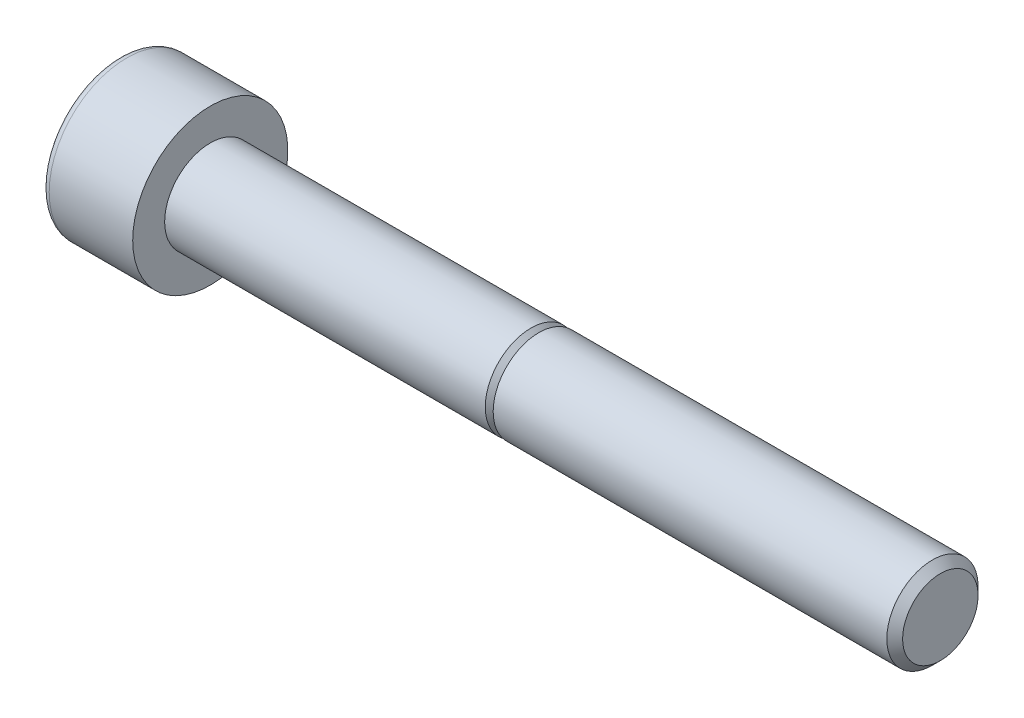
ISO-10303-21;
HEADER;
FILE_DESCRIPTION(('STEP AP214'),'2;1');
FILE_NAME('part.step','',(''),(''),'','','');
FILE_SCHEMA(('AUTOMOTIVE_DESIGN { 1 0 10303 214 1 1 1 1 }'));
ENDSEC;
DATA;
#1=APPLICATION_CONTEXT('core data for automotive mechanical design processes');
#2=APPLICATION_PROTOCOL_DEFINITION('international standard','automotive_design',2000,#1);
#3=PRODUCT_CONTEXT('',#1,'mechanical');
#4=PRODUCT('Part','Part','',(#3));
#5=PRODUCT_RELATED_PRODUCT_CATEGORY('part','',(#4));
#6=PRODUCT_DEFINITION_FORMATION('','',#4);
#7=PRODUCT_DEFINITION_CONTEXT('part definition',#1,'design');
#8=PRODUCT_DEFINITION('design','',#6,#7);
#9=PRODUCT_DEFINITION_SHAPE('','',#8);
#10=(LENGTH_UNIT() NAMED_UNIT(*) SI_UNIT(.MILLI.,.METRE.));
#11=(NAMED_UNIT(*) PLANE_ANGLE_UNIT() SI_UNIT($,.RADIAN.));
#12=(NAMED_UNIT(*) SI_UNIT($,.STERADIAN.) SOLID_ANGLE_UNIT());
#13=UNCERTAINTY_MEASURE_WITH_UNIT(LENGTH_MEASURE(1.E-05),#10,'distance_accuracy_value','');
#14=(GEOMETRIC_REPRESENTATION_CONTEXT(3) GLOBAL_UNCERTAINTY_ASSIGNED_CONTEXT((#13)) GLOBAL_UNIT_ASSIGNED_CONTEXT((#10,
#11,#12)) REPRESENTATION_CONTEXT('',''));
#15=CARTESIAN_POINT('',(0.,0.,0.));
#16=DIRECTION('',(0.,0.,1.));
#17=DIRECTION('',(1.,0.,0.));
#18=AXIS2_PLACEMENT_3D('',#15,#16,#17);
#19=CARTESIAN_POINT('',(0.,0.,0.));
#20=DIRECTION('',(-1.,0.,0.));
#21=DIRECTION('',(0.,0.,1.));
#22=AXIS2_PLACEMENT_3D('',#19,#20,#21);
#23=PLANE('',#22);
#24=CARTESIAN_POINT('',(0.,0.,0.));
#25=DIRECTION('',(-1.,0.,0.));
#26=DIRECTION('',(0.,0.,1.));
#27=AXIS2_PLACEMENT_3D('',#24,#25,#26);
#28=CIRCLE('',#27,4.25);
#29=CARTESIAN_POINT('',(0.,0.,4.25));
#30=VERTEX_POINT('',#29);
#31=EDGE_CURVE('E109',#30,#30,#28,.T.);
#32=ORIENTED_EDGE('',*,*,#31,.F.);
#33=EDGE_LOOP('',(#32));
#34=FACE_BOUND('',#33,.T.);
#35=CARTESIAN_POINT('',(0.,0.,0.));
#36=DIRECTION('',(-1.,0.,0.));
#37=DIRECTION('',(0.,0.,1.));
#38=AXIS2_PLACEMENT_3D('',#35,#36,#37);
#39=CIRCLE('',#38,2.5);
#40=CARTESIAN_POINT('',(0.,0.,2.5));
#41=VERTEX_POINT('',#40);
#42=EDGE_CURVE('E11',#41,#41,#39,.F.);
#43=ORIENTED_EDGE('',*,*,#42,.F.);
#44=EDGE_LOOP('',(#43));
#45=FACE_BOUND('',#44,.T.);
#46=ADVANCED_FACE('F16',(#34,#45),#23,.F.);
#47=CARTESIAN_POINT('',(-5.,3.825,0.));
#48=DIRECTION('',(1.,0.,0.));
#49=DIRECTION('',(0.,0.,-1.));
#50=AXIS2_PLACEMENT_3D('',#47,#48,#49);
#51=PLANE('',#50);
#52=CARTESIAN_POINT('',(-5.,0.,0.));
#53=DIRECTION('',(-1.,0.,0.));
#54=DIRECTION('',(0.,0.,1.));
#55=AXIS2_PLACEMENT_3D('',#52,#53,#54);
#56=CIRCLE('',#55,3.825);
#57=CARTESIAN_POINT('',(-5.,0.,3.825));
#58=VERTEX_POINT('',#57);
#59=EDGE_CURVE('E91',#58,#58,#56,.T.);
#60=ORIENTED_EDGE('',*,*,#59,.T.);
#61=EDGE_LOOP('',(#60));
#62=FACE_BOUND('',#61,.T.);
#63=DIRECTION('',(0.,0.5,0.866025403784438));
#64=VECTOR('',#63,1.);
#65=CARTESIAN_POINT('',(-5.,-0.775800807568874,2.65627358473774));
#66=LINE('',#65,#64);
#67=CARTESIAN_POINT('',(-5.,-2.30940107675851,0.));
#68=VERTEX_POINT('',#67);
#69=CARTESIAN_POINT('',(-5.,-1.15470053837925,2.));
#70=VERTEX_POINT('',#69);
#71=EDGE_CURVE('E25',#68,#70,#66,.T.);
#72=ORIENTED_EDGE('',*,*,#71,.F.);
#73=DIRECTION('',(0.,-0.5,0.866025403784439));
#74=VECTOR('',#73,1.);
#75=CARTESIAN_POINT('',(-5.,-0.775800807568879,-2.65627358473774));
#76=LINE('',#75,#74);
#77=CARTESIAN_POINT('',(-5.,-1.15470053837925,-2.));
#78=VERTEX_POINT('',#77);
#79=EDGE_CURVE('E40',#78,#68,#76,.T.);
#80=ORIENTED_EDGE('',*,*,#79,.F.);
#81=DIRECTION('',(0.,-1.,0.));
#82=VECTOR('',#81,1.);
#83=CARTESIAN_POINT('',(-5.,3.825,-2.));
#84=LINE('',#83,#82);
#85=CARTESIAN_POINT('',(-5.,1.15470053837925,-2.));
#86=VERTEX_POINT('',#85);
#87=EDGE_CURVE('E122',#86,#78,#84,.T.);
#88=ORIENTED_EDGE('',*,*,#87,.F.);
#89=DIRECTION('',(0.,-0.5,-0.866025403784439));
#90=VECTOR('',#89,1.);
#91=CARTESIAN_POINT('',(-5.,2.68830080756888,0.656273584737739));
#92=LINE('',#91,#90);
#93=CARTESIAN_POINT('',(-5.,2.30940107675851,0.));
#94=VERTEX_POINT('',#93);
#95=EDGE_CURVE('E119',#94,#86,#92,.T.);
#96=ORIENTED_EDGE('',*,*,#95,.F.);
#97=DIRECTION('',(0.,0.5,-0.866025403784439));
#98=VECTOR('',#97,1.);
#99=CARTESIAN_POINT('',(-5.,2.68830080756888,-0.656273584737739));
#100=LINE('',#99,#98);
#101=CARTESIAN_POINT('',(-5.,1.15470053837925,2.));
#102=VERTEX_POINT('',#101);
#103=EDGE_CURVE('E116',#102,#94,#100,.T.);
#104=ORIENTED_EDGE('',*,*,#103,.F.);
#105=DIRECTION('',(0.,1.,0.));
#106=VECTOR('',#105,1.);
#107=CARTESIAN_POINT('',(-5.,3.825,2.));
#108=LINE('',#107,#106);
#109=EDGE_CURVE('E113',#70,#102,#108,.T.);
#110=ORIENTED_EDGE('',*,*,#109,.F.);
#111=EDGE_LOOP('',(#72,#80,#88,#96,#104,#110));
#112=FACE_BOUND('',#111,.T.);
#113=ADVANCED_FACE('F18',(#62,#112),#51,.F.);
#114=CARTESIAN_POINT('',(-5.,0.,0.));
#115=DIRECTION('',(-1.,0.,0.));
#116=DIRECTION('',(0.,0.,1.));
#117=AXIS2_PLACEMENT_3D('',#114,#115,#116);
#118=CYLINDRICAL_SURFACE('',#117,4.25);
#119=CARTESIAN_POINT('',(-4.575,0.,0.));
#120=DIRECTION('',(-1.,0.,0.));
#121=DIRECTION('',(0.,0.,1.));
#122=AXIS2_PLACEMENT_3D('',#119,#120,#121);
#123=CIRCLE('',#122,4.25);
#124=CARTESIAN_POINT('',(-4.575,0.,4.25));
#125=VERTEX_POINT('',#124);
#126=EDGE_CURVE('E99',#125,#125,#123,.T.);
#127=ORIENTED_EDGE('',*,*,#126,.F.);
#128=EDGE_LOOP('',(#127));
#129=FACE_BOUND('',#128,.T.);
#130=ORIENTED_EDGE('',*,*,#31,.T.);
#131=EDGE_LOOP('',(#130));
#132=FACE_BOUND('',#131,.T.);
#133=ADVANCED_FACE('F238',(#129,#132),#118,.T.);
#134=CARTESIAN_POINT('',(-4.575,0.,0.));
#135=DIRECTION('',(-1.,0.,0.));
#136=DIRECTION('',(0.,0.,1.));
#137=AXIS2_PLACEMENT_3D('',#134,#135,#136);
#138=TOROIDAL_SURFACE('',#137,3.825,0.425);
#139=ORIENTED_EDGE('',*,*,#59,.F.);
#140=EDGE_LOOP('',(#139));
#141=FACE_BOUND('',#140,.T.);
#142=ORIENTED_EDGE('',*,*,#126,.T.);
#143=EDGE_LOOP('',(#142));
#144=FACE_BOUND('',#143,.T.);
#145=ADVANCED_FACE('F245',(#141,#144),#138,.T.);
#146=CARTESIAN_POINT('',(-2.5,-1.15470053837925,2.));
#147=DIRECTION('',(0.,0.866025403784438,-0.5));
#148=DIRECTION('',(0.,0.5,0.866025403784438));
#149=AXIS2_PLACEMENT_3D('',#146,#147,#148);
#150=PLANE('',#149);
#151=ORIENTED_EDGE('',*,*,#71,.T.);
#152=DIRECTION('',(-1.,0.,0.));
#153=VECTOR('',#152,1.);
#154=CARTESIAN_POINT('',(-2.5,-1.15470053837925,2.));
#155=LINE('',#154,#153);
#156=CARTESIAN_POINT('',(-2.5,-1.15470053837925,2.));
#157=VERTEX_POINT('',#156);
#158=EDGE_CURVE('E32',#157,#70,#155,.T.);
#159=ORIENTED_EDGE('',*,*,#158,.F.);
#160=DIRECTION('',(0.,-0.5,-0.866025403784439));
#161=VECTOR('',#160,1.);
#162=CARTESIAN_POINT('',(-2.5,-1.15470053837925,2.));
#163=LINE('',#162,#161);
#164=CARTESIAN_POINT('',(-2.5,-2.30940107675851,0.));
#165=VERTEX_POINT('',#164);
#166=EDGE_CURVE('E76',#157,#165,#163,.T.);
#167=ORIENTED_EDGE('',*,*,#166,.T.);
#168=DIRECTION('',(-1.,0.,0.));
#169=VECTOR('',#168,1.);
#170=CARTESIAN_POINT('',(-2.5,-2.30940107675851,0.));
#171=LINE('',#170,#169);
#172=EDGE_CURVE('E84',#165,#68,#171,.T.);
#173=ORIENTED_EDGE('',*,*,#172,.T.);
#174=EDGE_LOOP('',(#151,#159,#167,#173));
#175=FACE_BOUND('',#174,.T.);
#176=ADVANCED_FACE('F83',(#175),#150,.T.);
#177=CARTESIAN_POINT('',(-2.5,-2.30940107675851,0.));
#178=DIRECTION('',(0.,0.866025403784439,0.5));
#179=DIRECTION('',(0.,-0.5,0.866025403784439));
#180=AXIS2_PLACEMENT_3D('',#177,#178,#179);
#181=PLANE('',#180);
#182=ORIENTED_EDGE('',*,*,#79,.T.);
#183=ORIENTED_EDGE('',*,*,#172,.F.);
#184=DIRECTION('',(0.,0.5,-0.866025403784439));
#185=VECTOR('',#184,1.);
#186=CARTESIAN_POINT('',(-2.5,-2.30940107675851,0.));
#187=LINE('',#186,#185);
#188=CARTESIAN_POINT('',(-2.5,-1.15470053837925,-2.));
#189=VERTEX_POINT('',#188);
#190=EDGE_CURVE('E72',#165,#189,#187,.T.);
#191=ORIENTED_EDGE('',*,*,#190,.T.);
#192=DIRECTION('',(-1.,0.,0.));
#193=VECTOR('',#192,1.);
#194=CARTESIAN_POINT('',(-2.5,-1.15470053837925,-2.));
#195=LINE('',#194,#193);
#196=EDGE_CURVE('E92',#189,#78,#195,.T.);
#197=ORIENTED_EDGE('',*,*,#196,.T.);
#198=EDGE_LOOP('',(#182,#183,#191,#197));
#199=FACE_BOUND('',#198,.T.);
#200=ADVANCED_FACE('F89',(#199),#181,.T.);
#201=CARTESIAN_POINT('',(-2.5,-1.15470053837925,-2.));
#202=DIRECTION('',(0.,0.,1.));
#203=DIRECTION('',(0.,-1.,0.));
#204=AXIS2_PLACEMENT_3D('',#201,#202,#203);
#205=PLANE('',#204);
#206=ORIENTED_EDGE('',*,*,#87,.T.);
#207=ORIENTED_EDGE('',*,*,#196,.F.);
#208=DIRECTION('',(0.,1.,0.));
#209=VECTOR('',#208,1.);
#210=CARTESIAN_POINT('',(-2.5,-1.15470053837925,-2.));
#211=LINE('',#210,#209);
#212=CARTESIAN_POINT('',(-2.5,1.15470053837925,-2.));
#213=VERTEX_POINT('',#212);
#214=EDGE_CURVE('E78',#189,#213,#211,.T.);
#215=ORIENTED_EDGE('',*,*,#214,.T.);
#216=DIRECTION('',(-1.,0.,0.));
#217=VECTOR('',#216,1.);
#218=CARTESIAN_POINT('',(-2.5,1.15470053837925,-2.));
#219=LINE('',#218,#217);
#220=EDGE_CURVE('E102',#213,#86,#219,.T.);
#221=ORIENTED_EDGE('',*,*,#220,.T.);
#222=EDGE_LOOP('',(#206,#207,#215,#221));
#223=FACE_BOUND('',#222,.T.);
#224=ADVANCED_FACE('F161',(#223),#205,.T.);
#225=CARTESIAN_POINT('',(-2.5,1.15470053837925,-2.));
#226=DIRECTION('',(0.,-0.866025403784438,0.5));
#227=DIRECTION('',(0.,-0.5,-0.866025403784439));
#228=AXIS2_PLACEMENT_3D('',#225,#226,#227);
#229=PLANE('',#228);
#230=ORIENTED_EDGE('',*,*,#95,.T.);
#231=ORIENTED_EDGE('',*,*,#220,.F.);
#232=DIRECTION('',(0.,0.5,0.866025403784439));
#233=VECTOR('',#232,1.);
#234=CARTESIAN_POINT('',(-2.5,1.15470053837925,-2.));
#235=LINE('',#234,#233);
#236=CARTESIAN_POINT('',(-2.5,2.30940107675851,0.));
#237=VERTEX_POINT('',#236);
#238=EDGE_CURVE('E164',#213,#237,#235,.T.);
#239=ORIENTED_EDGE('',*,*,#238,.T.);
#240=DIRECTION('',(-1.,0.,0.));
#241=VECTOR('',#240,1.);
#242=CARTESIAN_POINT('',(-2.5,2.30940107675851,0.));
#243=LINE('',#242,#241);
#244=EDGE_CURVE('E143',#237,#94,#243,.T.);
#245=ORIENTED_EDGE('',*,*,#244,.T.);
#246=EDGE_LOOP('',(#230,#231,#239,#245));
#247=FACE_BOUND('',#246,.T.);
#248=ADVANCED_FACE('F163',(#247),#229,.T.);
#249=CARTESIAN_POINT('',(-2.5,2.30940107675851,0.));
#250=DIRECTION('',(0.,-0.866025403784439,-0.5));
#251=DIRECTION('',(0.,0.5,-0.866025403784439));
#252=AXIS2_PLACEMENT_3D('',#249,#250,#251);
#253=PLANE('',#252);
#254=ORIENTED_EDGE('',*,*,#103,.T.);
#255=ORIENTED_EDGE('',*,*,#244,.F.);
#256=DIRECTION('',(0.,-0.5,0.866025403784439));
#257=VECTOR('',#256,1.);
#258=CARTESIAN_POINT('',(-2.5,2.30940107675851,0.));
#259=LINE('',#258,#257);
#260=CARTESIAN_POINT('',(-2.5,1.15470053837925,2.));
#261=VERTEX_POINT('',#260);
#262=EDGE_CURVE('E141',#237,#261,#259,.T.);
#263=ORIENTED_EDGE('',*,*,#262,.T.);
#264=DIRECTION('',(-1.,0.,0.));
#265=VECTOR('',#264,1.);
#266=CARTESIAN_POINT('',(-2.5,1.15470053837925,2.));
#267=LINE('',#266,#265);
#268=EDGE_CURVE('E135',#261,#102,#267,.T.);
#269=ORIENTED_EDGE('',*,*,#268,.T.);
#270=EDGE_LOOP('',(#254,#255,#263,#269));
#271=FACE_BOUND('',#270,.T.);
#272=ADVANCED_FACE('F137',(#271),#253,.T.);
#273=CARTESIAN_POINT('',(-2.5,1.15470053837925,2.));
#274=DIRECTION('',(0.,0.,-1.));
#275=DIRECTION('',(0.,1.,0.));
#276=AXIS2_PLACEMENT_3D('',#273,#274,#275);
#277=PLANE('',#276);
#278=ORIENTED_EDGE('',*,*,#109,.T.);
#279=ORIENTED_EDGE('',*,*,#268,.F.);
#280=DIRECTION('',(0.,-1.,0.));
#281=VECTOR('',#280,1.);
#282=CARTESIAN_POINT('',(-2.5,1.15470053837925,2.));
#283=LINE('',#282,#281);
#284=EDGE_CURVE('E151',#261,#157,#283,.T.);
#285=ORIENTED_EDGE('',*,*,#284,.T.);
#286=ORIENTED_EDGE('',*,*,#158,.T.);
#287=EDGE_LOOP('',(#278,#279,#285,#286));
#288=FACE_BOUND('',#287,.T.);
#289=ADVANCED_FACE('F134',(#288),#277,.T.);
#290=CARTESIAN_POINT('',(-2.5,-2.30940107675851,0.));
#291=DIRECTION('',(1.,0.,0.));
#292=DIRECTION('',(0.,0.,1.));
#293=AXIS2_PLACEMENT_3D('',#290,#291,#292);
#294=PLANE('',#293);
#295=ORIENTED_EDGE('',*,*,#166,.F.);
#296=ORIENTED_EDGE('',*,*,#284,.F.);
#297=ORIENTED_EDGE('',*,*,#262,.F.);
#298=ORIENTED_EDGE('',*,*,#238,.F.);
#299=ORIENTED_EDGE('',*,*,#214,.F.);
#300=ORIENTED_EDGE('',*,*,#190,.F.);
#301=EDGE_LOOP('',(#295,#296,#297,#298,#299,#300));
#302=FACE_BOUND('',#301,.T.);
#303=ADVANCED_FACE('F74',(#302),#294,.F.);
#304=CARTESIAN_POINT('',(0.,0.,0.));
#305=DIRECTION('',(-1.,0.,0.));
#306=DIRECTION('',(0.,0.,1.));
#307=AXIS2_PLACEMENT_3D('',#304,#305,#306);
#308=CYLINDRICAL_SURFACE('',#307,2.5);
#309=CARTESIAN_POINT('',(17.567,0.,0.));
#310=DIRECTION('',(-1.,0.,0.));
#311=DIRECTION('',(0.,0.,1.));
#312=AXIS2_PLACEMENT_3D('',#309,#310,#311);
#313=CIRCLE('',#312,2.5);
#314=CARTESIAN_POINT('',(17.567,0.,2.5));
#315=VERTEX_POINT('',#314);
#316=EDGE_CURVE('E189',#315,#315,#313,.T.);
#317=ORIENTED_EDGE('',*,*,#316,.T.);
#318=EDGE_LOOP('',(#317));
#319=FACE_BOUND('',#318,.T.);
#320=ORIENTED_EDGE('',*,*,#42,.T.);
#321=EDGE_LOOP('',(#320));
#322=FACE_BOUND('',#321,.T.);
#323=ADVANCED_FACE('F197',(#319,#322),#308,.T.);
#324=CARTESIAN_POINT('',(40.,0.,0.));
#325=DIRECTION('',(-1.,0.,0.));
#326=DIRECTION('',(0.,0.,1.));
#327=AXIS2_PLACEMENT_3D('',#324,#325,#326);
#328=PLANE('',#327);
#329=CARTESIAN_POINT('',(40.,0.,0.));
#330=DIRECTION('',(-1.,0.,0.));
#331=DIRECTION('',(0.,0.,1.));
#332=AXIS2_PLACEMENT_3D('',#329,#330,#331);
#333=CIRCLE('',#332,2.067);
#334=CARTESIAN_POINT('',(40.,0.,2.067));
#335=VERTEX_POINT('',#334);
#336=EDGE_CURVE('E87',#335,#335,#333,.T.);
#337=ORIENTED_EDGE('',*,*,#336,.F.);
#338=EDGE_LOOP('',(#337));
#339=FACE_BOUND('',#338,.T.);
#340=ADVANCED_FACE('F221',(#339),#328,.F.);
#341=CARTESIAN_POINT('',(40.,0.,0.));
#342=DIRECTION('',(-1.,0.,0.));
#343=DIRECTION('',(0.,0.,1.));
#344=AXIS2_PLACEMENT_3D('',#341,#342,#343);
#345=CONICAL_SURFACE('',#344,2.067,0.785398163397449);
#346=CARTESIAN_POINT('',(39.567,0.,0.));
#347=DIRECTION('',(-1.,0.,0.));
#348=DIRECTION('',(0.,0.,1.));
#349=AXIS2_PLACEMENT_3D('',#346,#347,#348);
#350=CIRCLE('',#349,2.5);
#351=CARTESIAN_POINT('',(39.567,0.,2.5));
#352=VERTEX_POINT('',#351);
#353=EDGE_CURVE('E177',#352,#352,#350,.T.);
#354=ORIENTED_EDGE('',*,*,#353,.F.);
#355=EDGE_LOOP('',(#354));
#356=FACE_BOUND('',#355,.T.);
#357=ORIENTED_EDGE('',*,*,#336,.T.);
#358=EDGE_LOOP('',(#357));
#359=FACE_BOUND('',#358,.T.);
#360=ADVANCED_FACE('F215',(#356,#359),#345,.T.);
#361=CARTESIAN_POINT('',(0.,0.,0.));
#362=DIRECTION('',(-1.,0.,0.));
#363=DIRECTION('',(0.,0.,1.));
#364=AXIS2_PLACEMENT_3D('',#361,#362,#363);
#365=CYLINDRICAL_SURFACE('',#364,2.5);
#366=CARTESIAN_POINT('',(18.,0.,0.));
#367=DIRECTION('',(-1.,0.,0.));
#368=DIRECTION('',(0.,0.,1.));
#369=AXIS2_PLACEMENT_3D('',#366,#367,#368);
#370=CIRCLE('',#369,2.5);
#371=CARTESIAN_POINT('',(18.,0.,2.5));
#372=VERTEX_POINT('',#371);
#373=EDGE_CURVE('E181',#372,#372,#370,.T.);
#374=ORIENTED_EDGE('',*,*,#373,.F.);
#375=EDGE_LOOP('',(#374));
#376=FACE_BOUND('',#375,.T.);
#377=ORIENTED_EDGE('',*,*,#353,.T.);
#378=EDGE_LOOP('',(#377));
#379=FACE_BOUND('',#378,.T.);
#380=ADVANCED_FACE('F209',(#376,#379),#365,.T.);
#381=CARTESIAN_POINT('',(18.,2.5,0.));
#382=DIRECTION('',(1.,0.,0.));
#383=DIRECTION('',(0.,0.,-1.));
#384=AXIS2_PLACEMENT_3D('',#381,#382,#383);
#385=PLANE('',#384);
#386=CARTESIAN_POINT('',(18.,0.,0.));
#387=DIRECTION('',(-1.,0.,0.));
#388=DIRECTION('',(0.,0.,1.));
#389=AXIS2_PLACEMENT_3D('',#386,#387,#388);
#390=CIRCLE('',#389,2.067);
#391=CARTESIAN_POINT('',(18.,0.,2.067));
#392=VERTEX_POINT('',#391);
#393=EDGE_CURVE('E185',#392,#392,#390,.T.);
#394=ORIENTED_EDGE('',*,*,#393,.F.);
#395=EDGE_LOOP('',(#394));
#396=FACE_BOUND('',#395,.T.);
#397=ORIENTED_EDGE('',*,*,#373,.T.);
#398=EDGE_LOOP('',(#397));
#399=FACE_BOUND('',#398,.T.);
#400=ADVANCED_FACE('F203',(#396,#399),#385,.F.);
#401=CARTESIAN_POINT('',(18.,0.,0.));
#402=DIRECTION('',(-1.,0.,0.));
#403=DIRECTION('',(0.,0.,1.));
#404=AXIS2_PLACEMENT_3D('',#401,#402,#403);
#405=CONICAL_SURFACE('',#404,2.067,0.785398163397449);
#406=ORIENTED_EDGE('',*,*,#316,.F.);
#407=EDGE_LOOP('',(#406));
#408=FACE_BOUND('',#407,.T.);
#409=ORIENTED_EDGE('',*,*,#393,.T.);
#410=EDGE_LOOP('',(#409));
#411=FACE_BOUND('',#410,.T.);
#412=ADVANCED_FACE('F200',(#408,#411),#405,.T.);
#413=CLOSED_SHELL('',(#46,#113,#133,#145,#176,#200,#224,#248,#272,#289,#303,#323,#340,#360,#380,
#400,#412));
#414=MANIFOLD_SOLID_BREP('B1',#413);
#415=ADVANCED_BREP_SHAPE_REPRESENTATION('',(#18,#414),#14);
#416=SHAPE_DEFINITION_REPRESENTATION(#9,#415);
ENDSEC;
END-ISO-10303-21;
